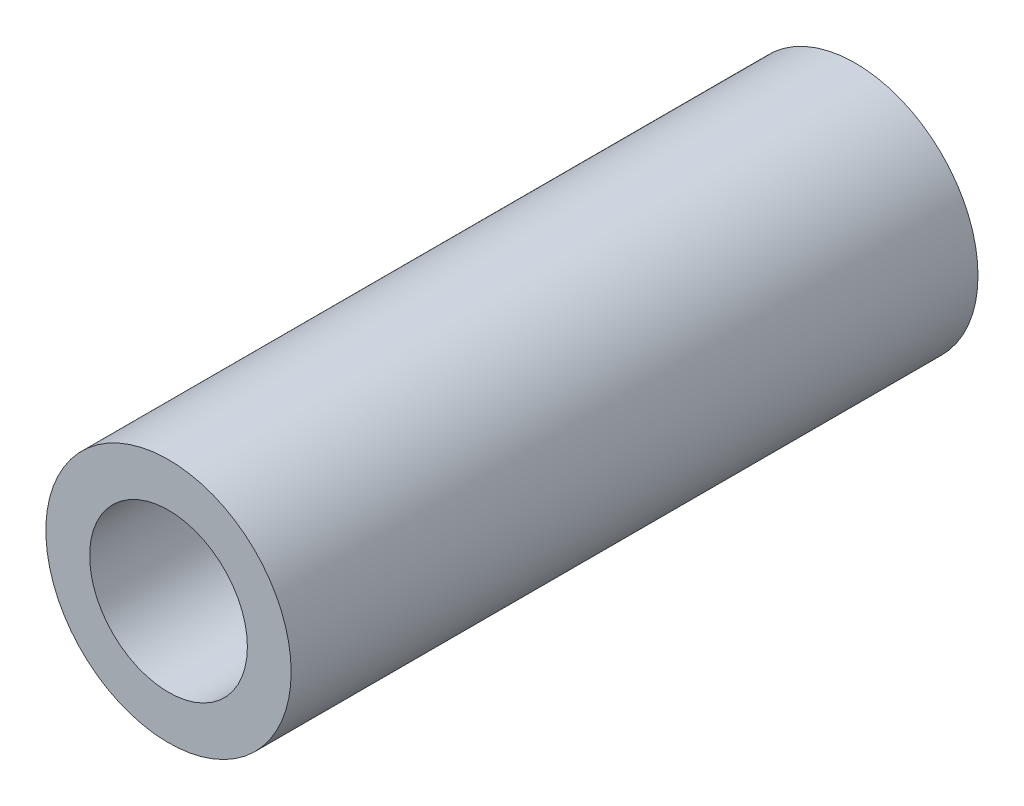
ISO-10303-21;
HEADER;
FILE_DESCRIPTION(('STEP AP214'),'2;1');
FILE_NAME('part.step','',(''),(''),'','','');
FILE_SCHEMA(('AUTOMOTIVE_DESIGN { 1 0 10303 214 1 1 1 1 }'));
ENDSEC;
DATA;
#1=APPLICATION_CONTEXT('core data for automotive mechanical design processes');
#2=APPLICATION_PROTOCOL_DEFINITION('international standard','automotive_design',2000,#1);
#3=PRODUCT_CONTEXT('',#1,'mechanical');
#4=PRODUCT('Part','Part','',(#3));
#5=PRODUCT_RELATED_PRODUCT_CATEGORY('part','',(#4));
#6=PRODUCT_DEFINITION_FORMATION('','',#4);
#7=PRODUCT_DEFINITION_CONTEXT('part definition',#1,'design');
#8=PRODUCT_DEFINITION('design','',#6,#7);
#9=PRODUCT_DEFINITION_SHAPE('','',#8);
#10=(LENGTH_UNIT() NAMED_UNIT(*) SI_UNIT(.MILLI.,.METRE.));
#11=(NAMED_UNIT(*) PLANE_ANGLE_UNIT() SI_UNIT($,.RADIAN.));
#12=(NAMED_UNIT(*) SI_UNIT($,.STERADIAN.) SOLID_ANGLE_UNIT());
#13=UNCERTAINTY_MEASURE_WITH_UNIT(LENGTH_MEASURE(1.E-05),#10,'distance_accuracy_value','');
#14=(GEOMETRIC_REPRESENTATION_CONTEXT(3) GLOBAL_UNCERTAINTY_ASSIGNED_CONTEXT((#13)) GLOBAL_UNIT_ASSIGNED_CONTEXT((#10,
#11,#12)) REPRESENTATION_CONTEXT('',''));
#15=CARTESIAN_POINT('',(0.,0.,0.));
#16=DIRECTION('',(0.,0.,1.));
#17=DIRECTION('',(1.,0.,0.));
#18=AXIS2_PLACEMENT_3D('',#15,#16,#17);
#19=CARTESIAN_POINT('',(0.,0.,22.225));
#20=DIRECTION('',(0.,0.,1.));
#21=DIRECTION('',(1.,0.,0.));
#22=AXIS2_PLACEMENT_3D('',#19,#20,#21);
#23=PLANE('',#22);
#24=CARTESIAN_POINT('',(0.,0.,22.225));
#25=DIRECTION('',(0.,0.,1.));
#26=DIRECTION('',(1.,0.,0.));
#27=AXIS2_PLACEMENT_3D('',#24,#25,#26);
#28=CIRCLE('',#27,3.96875);
#29=CARTESIAN_POINT('',(3.96875,0.,22.225));
#30=VERTEX_POINT('',#29);
#31=EDGE_CURVE('E10',#30,#30,#28,.T.);
#32=ORIENTED_EDGE('',*,*,#31,.T.);
#33=EDGE_LOOP('',(#32));
#34=FACE_BOUND('',#33,.T.);
#35=CARTESIAN_POINT('',(0.,0.,22.225));
#36=DIRECTION('',(0.,0.,1.));
#37=DIRECTION('',(1.,0.,0.));
#38=AXIS2_PLACEMENT_3D('',#35,#36,#37);
#39=CIRCLE('',#38,2.5527);
#40=CARTESIAN_POINT('',(2.5527,0.,22.225));
#41=VERTEX_POINT('',#40);
#42=EDGE_CURVE('E47',#41,#41,#39,.T.);
#43=ORIENTED_EDGE('',*,*,#42,.F.);
#44=EDGE_LOOP('',(#43));
#45=FACE_BOUND('',#44,.T.);
#46=ADVANCED_FACE('F36',(#34,#45),#23,.T.);
#47=CARTESIAN_POINT('',(0.,0.,0.));
#48=DIRECTION('',(0.,0.,1.));
#49=DIRECTION('',(1.,0.,0.));
#50=AXIS2_PLACEMENT_3D('',#47,#48,#49);
#51=PLANE('',#50);
#52=CARTESIAN_POINT('',(0.,0.,0.));
#53=DIRECTION('',(0.,0.,1.));
#54=DIRECTION('',(1.,0.,0.));
#55=AXIS2_PLACEMENT_3D('',#52,#53,#54);
#56=CIRCLE('',#55,3.96875);
#57=CARTESIAN_POINT('',(3.96875,0.,0.));
#58=VERTEX_POINT('',#57);
#59=EDGE_CURVE('E40',#58,#58,#56,.T.);
#60=ORIENTED_EDGE('',*,*,#59,.F.);
#61=EDGE_LOOP('',(#60));
#62=FACE_BOUND('',#61,.T.);
#63=CARTESIAN_POINT('',(0.,0.,0.));
#64=DIRECTION('',(0.,0.,1.));
#65=DIRECTION('',(1.,0.,0.));
#66=AXIS2_PLACEMENT_3D('',#63,#64,#65);
#67=CIRCLE('',#66,2.5527);
#68=CARTESIAN_POINT('',(2.5527,0.,0.));
#69=VERTEX_POINT('',#68);
#70=EDGE_CURVE('E49',#69,#69,#67,.T.);
#71=ORIENTED_EDGE('',*,*,#70,.T.);
#72=EDGE_LOOP('',(#71));
#73=FACE_BOUND('',#72,.T.);
#74=ADVANCED_FACE('F59',(#62,#73),#51,.F.);
#75=CARTESIAN_POINT('',(0.,0.,22.225));
#76=DIRECTION('',(0.,0.,-1.));
#77=DIRECTION('',(-1.,0.,0.));
#78=AXIS2_PLACEMENT_3D('',#75,#76,#77);
#79=CYLINDRICAL_SURFACE('',#78,3.96875);
#80=ORIENTED_EDGE('',*,*,#31,.F.);
#81=EDGE_LOOP('',(#80));
#82=FACE_BOUND('',#81,.T.);
#83=ORIENTED_EDGE('',*,*,#59,.T.);
#84=EDGE_LOOP('',(#83));
#85=FACE_BOUND('',#84,.T.);
#86=ADVANCED_FACE('F38',(#82,#85),#79,.T.);
#87=CARTESIAN_POINT('',(0.,0.,22.225));
#88=DIRECTION('',(0.,0.,-1.));
#89=DIRECTION('',(-1.,0.,0.));
#90=AXIS2_PLACEMENT_3D('',#87,#88,#89);
#91=CYLINDRICAL_SURFACE('',#90,2.5527);
#92=ORIENTED_EDGE('',*,*,#42,.T.);
#93=EDGE_LOOP('',(#92));
#94=FACE_BOUND('',#93,.T.);
#95=ORIENTED_EDGE('',*,*,#70,.F.);
#96=EDGE_LOOP('',(#95));
#97=FACE_BOUND('',#96,.T.);
#98=ADVANCED_FACE('F55',(#94,#97),#91,.F.);
#99=CLOSED_SHELL('',(#46,#74,#86,#98));
#100=MANIFOLD_SOLID_BREP('B2',#99);
#101=ADVANCED_BREP_SHAPE_REPRESENTATION('',(#18,#100),#14);
#102=SHAPE_DEFINITION_REPRESENTATION(#9,#101);
ENDSEC;
END-ISO-10303-21;
